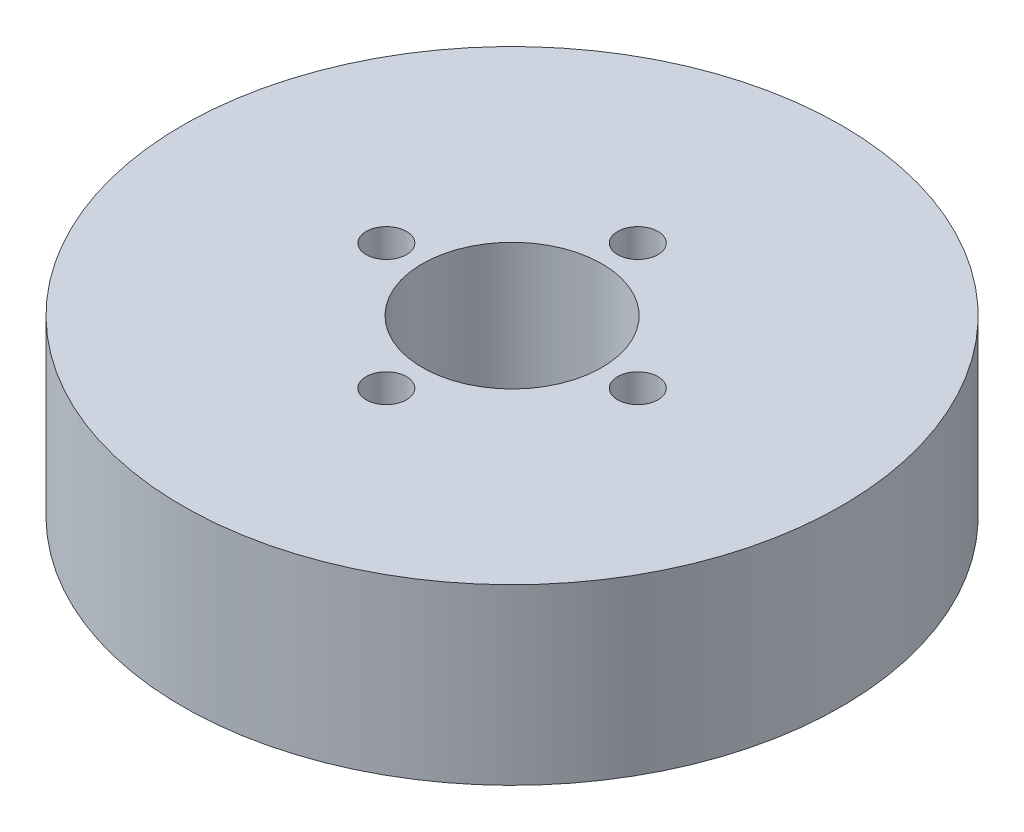
ISO-10303-21;
HEADER;
FILE_DESCRIPTION(('STEP AP214'),'2;1');
FILE_NAME('part.step','',(''),(''),'','','');
FILE_SCHEMA(('AUTOMOTIVE_DESIGN { 1 0 10303 214 1 1 1 1 }'));
ENDSEC;
DATA;
#1=APPLICATION_CONTEXT('core data for automotive mechanical design processes');
#2=APPLICATION_PROTOCOL_DEFINITION('international standard','automotive_design',2000,#1);
#3=PRODUCT_CONTEXT('',#1,'mechanical');
#4=PRODUCT('Part','Part','',(#3));
#5=PRODUCT_RELATED_PRODUCT_CATEGORY('part','',(#4));
#6=PRODUCT_DEFINITION_FORMATION('','',#4);
#7=PRODUCT_DEFINITION_CONTEXT('part definition',#1,'design');
#8=PRODUCT_DEFINITION('design','',#6,#7);
#9=PRODUCT_DEFINITION_SHAPE('','',#8);
#10=(LENGTH_UNIT() NAMED_UNIT(*) SI_UNIT(.MILLI.,.METRE.));
#11=(NAMED_UNIT(*) PLANE_ANGLE_UNIT() SI_UNIT($,.RADIAN.));
#12=(NAMED_UNIT(*) SI_UNIT($,.STERADIAN.) SOLID_ANGLE_UNIT());
#13=UNCERTAINTY_MEASURE_WITH_UNIT(LENGTH_MEASURE(1.E-05),#10,'distance_accuracy_value','');
#14=(GEOMETRIC_REPRESENTATION_CONTEXT(3) GLOBAL_UNCERTAINTY_ASSIGNED_CONTEXT((#13)) GLOBAL_UNIT_ASSIGNED_CONTEXT((#10,
#11,#12)) REPRESENTATION_CONTEXT('',''));
#15=CARTESIAN_POINT('',(0.,0.,0.));
#16=DIRECTION('',(0.,0.,1.));
#17=DIRECTION('',(1.,0.,0.));
#18=AXIS2_PLACEMENT_3D('',#15,#16,#17);
#19=CARTESIAN_POINT('',(0.,29.,0.));
#20=DIRECTION('',(0.,-1.,0.));
#21=DIRECTION('',(0.,0.,-1.));
#22=AXIS2_PLACEMENT_3D('',#19,#20,#21);
#23=CYLINDRICAL_SURFACE('',#22,55.);
#24=CARTESIAN_POINT('',(0.,29.,0.));
#25=DIRECTION('',(0.,1.,0.));
#26=DIRECTION('',(0.,0.,1.));
#27=AXIS2_PLACEMENT_3D('',#24,#25,#26);
#28=CIRCLE('',#27,55.);
#29=CARTESIAN_POINT('',(0.,29.,-55.));
#30=VERTEX_POINT('',#29);
#31=EDGE_CURVE('E10',#30,#30,#28,.T.);
#32=CARTESIAN_POINT('',(0.,0.,0.));
#33=DIRECTION('',(0.,1.,0.));
#34=DIRECTION('',(0.,0.,1.));
#35=AXIS2_PLACEMENT_3D('',#32,#33,#34);
#36=CIRCLE('',#35,55.);
#37=CARTESIAN_POINT('',(0.,0.,-55.));
#38=VERTEX_POINT('',#37);
#39=EDGE_CURVE('E37',#38,#38,#36,.T.);
#40=CARTESIAN_POINT('',(0.,29.,-55.));
#41=CARTESIAN_POINT('',(0.,28.6979166666667,-55.));
#42=CARTESIAN_POINT('',(0.,28.3958333333333,-55.));
#43=CARTESIAN_POINT('',(0.,27.7916666666667,-55.));
#44=CARTESIAN_POINT('',(0.,27.4895833333333,-55.));
#45=CARTESIAN_POINT('',(0.,26.8854166666667,-55.));
#46=CARTESIAN_POINT('',(0.,26.5833333333333,-55.));
#47=CARTESIAN_POINT('',(0.,25.9791666666667,-55.));
#48=CARTESIAN_POINT('',(0.,25.6770833333333,-55.));
#49=CARTESIAN_POINT('',(0.,25.0729166666667,-55.));
#50=CARTESIAN_POINT('',(0.,24.7708333333333,-55.));
#51=CARTESIAN_POINT('',(0.,24.1666666666667,-55.));
#52=CARTESIAN_POINT('',(0.,23.8645833333333,-55.));
#53=CARTESIAN_POINT('',(0.,23.2604166666667,-55.));
#54=CARTESIAN_POINT('',(0.,22.9583333333333,-55.));
#55=CARTESIAN_POINT('',(0.,22.3541666666667,-55.));
#56=CARTESIAN_POINT('',(0.,22.0520833333333,-55.));
#57=CARTESIAN_POINT('',(0.,21.4479166666667,-55.));
#58=CARTESIAN_POINT('',(0.,21.1458333333333,-55.));
#59=CARTESIAN_POINT('',(0.,20.5416666666667,-55.));
#60=CARTESIAN_POINT('',(0.,20.2395833333333,-55.));
#61=CARTESIAN_POINT('',(0.,19.6354166666667,-55.));
#62=CARTESIAN_POINT('',(0.,19.3333333333333,-55.));
#63=CARTESIAN_POINT('',(0.,18.7291666666667,-55.));
#64=CARTESIAN_POINT('',(0.,18.4270833333333,-55.));
#65=CARTESIAN_POINT('',(0.,17.8229166666667,-55.));
#66=CARTESIAN_POINT('',(0.,17.5208333333333,-55.));
#67=CARTESIAN_POINT('',(0.,16.9166666666667,-55.));
#68=CARTESIAN_POINT('',(0.,16.6145833333333,-55.));
#69=CARTESIAN_POINT('',(0.,16.0104166666667,-55.));
#70=CARTESIAN_POINT('',(0.,15.7083333333333,-55.));
#71=CARTESIAN_POINT('',(0.,15.1041666666667,-55.));
#72=CARTESIAN_POINT('',(0.,14.8020833333333,-55.));
#73=CARTESIAN_POINT('',(0.,14.1979166666667,-55.));
#74=CARTESIAN_POINT('',(0.,13.8958333333333,-55.));
#75=CARTESIAN_POINT('',(0.,13.2916666666667,-55.));
#76=CARTESIAN_POINT('',(0.,12.9895833333333,-55.));
#77=CARTESIAN_POINT('',(0.,12.3854166666667,-55.));
#78=CARTESIAN_POINT('',(0.,12.0833333333333,-55.));
#79=CARTESIAN_POINT('',(0.,11.4791666666667,-55.));
#80=CARTESIAN_POINT('',(0.,11.1770833333333,-55.));
#81=CARTESIAN_POINT('',(0.,10.5729166666667,-55.));
#82=CARTESIAN_POINT('',(0.,10.2708333333333,-55.));
#83=CARTESIAN_POINT('',(0.,9.66666666666667,-55.));
#84=CARTESIAN_POINT('',(0.,9.36458333333333,-55.));
#85=CARTESIAN_POINT('',(0.,8.76041666666667,-55.));
#86=CARTESIAN_POINT('',(0.,8.45833333333333,-55.));
#87=CARTESIAN_POINT('',(0.,7.85416666666667,-55.));
#88=CARTESIAN_POINT('',(0.,7.55208333333333,-55.));
#89=CARTESIAN_POINT('',(0.,6.94791666666667,-55.));
#90=CARTESIAN_POINT('',(0.,6.64583333333333,-55.));
#91=CARTESIAN_POINT('',(0.,6.04166666666667,-55.));
#92=CARTESIAN_POINT('',(0.,5.73958333333333,-55.));
#93=CARTESIAN_POINT('',(0.,5.13541666666667,-55.));
#94=CARTESIAN_POINT('',(0.,4.83333333333333,-55.));
#95=CARTESIAN_POINT('',(0.,4.22916666666667,-55.));
#96=CARTESIAN_POINT('',(0.,3.92708333333333,-55.));
#97=CARTESIAN_POINT('',(0.,3.32291666666667,-55.));
#98=CARTESIAN_POINT('',(0.,3.02083333333333,-55.));
#99=CARTESIAN_POINT('',(0.,2.41666666666667,-55.));
#100=CARTESIAN_POINT('',(0.,2.11458333333333,-55.));
#101=CARTESIAN_POINT('',(0.,1.51041666666667,-55.));
#102=CARTESIAN_POINT('',(0.,1.20833333333333,-55.));
#103=CARTESIAN_POINT('',(0.,0.604166666666667,-55.));
#104=CARTESIAN_POINT('',(0.,0.302083333333333,-55.));
#105=CARTESIAN_POINT('',(0.,0.,-55.));
#106=B_SPLINE_CURVE_WITH_KNOTS('',3,(#40,#41,#42,#43,#44,#45,#46,#47,#48,#49,#50,#51,#52,#53,
#54,#55,#56,#57,#58,#59,#60,#61,#62,#63,#64,#65,#66,#67,#68,#69,#70,#71,#72,#73,#74,#75,#76,#77,
#78,#79,#80,#81,#82,#83,#84,#85,#86,#87,#88,#89,#90,#91,#92,#93,#94,#95,#96,#97,#98,#99,#100,
#101,#102,#103,#104,#105),.UNSPECIFIED.,.F.,.F.,(4,2,2,2,2,2,2,2,2,2,2,2,2,2,2,2,2,2,2,2,2,2,2,
2,2,2,2,2,2,2,2,2,4),(0.,0.906250000000001,1.8125,2.71875,3.625,4.53125,5.4375,6.34375,7.25,
8.15625,9.0625,9.96875,10.875,11.78125,12.6875,13.59375,14.5,15.40625,16.3125,17.21875,18.125,
19.03125,19.9375,20.84375,21.75,22.65625,23.5625,24.46875,25.375,26.28125,27.1875,28.09375,29.),.UNSPECIFIED.);
#107=EDGE_CURVE('BSEAM40',#30,#38,#106,.T.);
#108=ORIENTED_EDGE('',*,*,#31,.F.);
#109=ORIENTED_EDGE('',*,*,#39,.T.);
#110=ORIENTED_EDGE('',*,*,#107,.T.);
#111=ORIENTED_EDGE('',*,*,#107,.F.);
#112=EDGE_LOOP('',(#108,#110,#109,#111));
#113=FACE_BOUND('',#112,.T.);
#114=ADVANCED_FACE('F40',(#113),#23,.T.);
#115=CARTESIAN_POINT('',(0.,29.,0.));
#116=DIRECTION('',(0.,1.,0.));
#117=DIRECTION('',(0.,0.,1.));
#118=AXIS2_PLACEMENT_3D('',#115,#116,#117);
#119=PLANE('',#118);
#120=CARTESIAN_POINT('',(0.,29.,20.9811069442111));
#121=DIRECTION('',(0.,1.,0.));
#122=DIRECTION('',(1.,0.,0.));
#123=AXIS2_PLACEMENT_3D('',#120,#121,#122);
#124=CIRCLE('',#123,3.36614820400758);
#125=CARTESIAN_POINT('',(3.36614820400765,29.,20.9811069442111));
#126=VERTEX_POINT('',#125);
#127=EDGE_CURVE('E71',#126,#126,#124,.T.);
#128=ORIENTED_EDGE('',*,*,#127,.F.);
#129=EDGE_LOOP('',(#128));
#130=FACE_BOUND('',#129,.T.);
#131=CARTESIAN_POINT('',(20.9811069442111,29.,0.));
#132=DIRECTION('',(0.,1.,0.));
#133=DIRECTION('',(0.,0.,-1.));
#134=AXIS2_PLACEMENT_3D('',#131,#132,#133);
#135=CIRCLE('',#134,3.36614820400758);
#136=CARTESIAN_POINT('',(20.9811069442111,29.,-3.36614820400758));
#137=VERTEX_POINT('',#136);
#138=EDGE_CURVE('E70',#137,#137,#135,.T.);
#139=ORIENTED_EDGE('',*,*,#138,.F.);
#140=EDGE_LOOP('',(#139));
#141=FACE_BOUND('',#140,.T.);
#142=CARTESIAN_POINT('',(-2.19765430091956E-13,29.,-20.9811069442111));
#143=DIRECTION('',(0.,1.,0.));
#144=DIRECTION('',(-1.,0.,0.));
#145=AXIS2_PLACEMENT_3D('',#142,#143,#144);
#146=CIRCLE('',#145,3.36614820400758);
#147=CARTESIAN_POINT('',(-3.3661482040078,29.,-20.9811069442111));
#148=VERTEX_POINT('',#147);
#149=EDGE_CURVE('E61',#148,#148,#146,.T.);
#150=ORIENTED_EDGE('',*,*,#149,.F.);
#151=EDGE_LOOP('',(#150));
#152=FACE_BOUND('',#151,.T.);
#153=CARTESIAN_POINT('',(-20.9811069442111,29.,0.));
#154=DIRECTION('',(0.,1.,0.));
#155=DIRECTION('',(0.,0.,1.));
#156=AXIS2_PLACEMENT_3D('',#153,#154,#155);
#157=CIRCLE('',#156,3.36614820400758);
#158=CARTESIAN_POINT('',(-20.9811069442111,29.,3.36614820400758));
#159=VERTEX_POINT('',#158);
#160=EDGE_CURVE('E54',#159,#159,#157,.T.);
#161=ORIENTED_EDGE('',*,*,#160,.F.);
#162=EDGE_LOOP('',(#161));
#163=FACE_BOUND('',#162,.T.);
#164=CARTESIAN_POINT('',(0.,29.,0.));
#165=DIRECTION('',(0.,1.,0.));
#166=DIRECTION('',(0.,0.,1.));
#167=AXIS2_PLACEMENT_3D('',#164,#165,#166);
#168=CIRCLE('',#167,15.);
#169=CARTESIAN_POINT('',(0.,29.,-15.));
#170=VERTEX_POINT('',#169);
#171=EDGE_CURVE('E50',#170,#170,#168,.T.);
#172=ORIENTED_EDGE('',*,*,#171,.F.);
#173=EDGE_LOOP('',(#172));
#174=FACE_BOUND('',#173,.T.);
#175=ORIENTED_EDGE('',*,*,#31,.T.);
#176=EDGE_LOOP('',(#175));
#177=FACE_BOUND('',#176,.T.);
#178=ADVANCED_FACE('F86',(#130,#141,#152,#163,#174,#177),#119,.T.);
#179=CARTESIAN_POINT('',(0.,0.,0.));
#180=DIRECTION('',(0.,1.,0.));
#181=DIRECTION('',(0.,0.,1.));
#182=AXIS2_PLACEMENT_3D('',#179,#180,#181);
#183=PLANE('',#182);
#184=CARTESIAN_POINT('',(0.,0.,0.));
#185=DIRECTION('',(0.,1.,0.));
#186=DIRECTION('',(0.,0.,1.));
#187=AXIS2_PLACEMENT_3D('',#184,#185,#186);
#188=CIRCLE('',#187,15.);
#189=CARTESIAN_POINT('',(0.,0.,-15.));
#190=VERTEX_POINT('',#189);
#191=EDGE_CURVE('E47',#190,#190,#188,.T.);
#192=ORIENTED_EDGE('',*,*,#191,.T.);
#193=EDGE_LOOP('',(#192));
#194=FACE_BOUND('',#193,.T.);
#195=ORIENTED_EDGE('',*,*,#39,.F.);
#196=EDGE_LOOP('',(#195));
#197=FACE_BOUND('',#196,.T.);
#198=ADVANCED_FACE('F93',(#194,#197),#183,.F.);
#199=CARTESIAN_POINT('',(0.,29.,0.));
#200=DIRECTION('',(0.,-1.,0.));
#201=DIRECTION('',(0.,0.,-1.));
#202=AXIS2_PLACEMENT_3D('',#199,#200,#201);
#203=CYLINDRICAL_SURFACE('',#202,15.);
#204=CARTESIAN_POINT('',(0.,29.,-15.));
#205=CARTESIAN_POINT('',(0.,28.6979166666667,-15.));
#206=CARTESIAN_POINT('',(0.,28.3958333333333,-15.));
#207=CARTESIAN_POINT('',(0.,27.7916666666667,-15.));
#208=CARTESIAN_POINT('',(0.,27.4895833333333,-15.));
#209=CARTESIAN_POINT('',(0.,26.8854166666667,-15.));
#210=CARTESIAN_POINT('',(0.,26.5833333333333,-15.));
#211=CARTESIAN_POINT('',(0.,25.9791666666667,-15.));
#212=CARTESIAN_POINT('',(0.,25.6770833333333,-15.));
#213=CARTESIAN_POINT('',(0.,25.0729166666667,-15.));
#214=CARTESIAN_POINT('',(0.,24.7708333333333,-15.));
#215=CARTESIAN_POINT('',(0.,24.1666666666667,-15.));
#216=CARTESIAN_POINT('',(0.,23.8645833333333,-15.));
#217=CARTESIAN_POINT('',(0.,23.2604166666667,-15.));
#218=CARTESIAN_POINT('',(0.,22.9583333333333,-15.));
#219=CARTESIAN_POINT('',(0.,22.3541666666667,-15.));
#220=CARTESIAN_POINT('',(0.,22.0520833333333,-15.));
#221=CARTESIAN_POINT('',(0.,21.4479166666667,-15.));
#222=CARTESIAN_POINT('',(0.,21.1458333333333,-15.));
#223=CARTESIAN_POINT('',(0.,20.5416666666667,-15.));
#224=CARTESIAN_POINT('',(0.,20.2395833333333,-15.));
#225=CARTESIAN_POINT('',(0.,19.6354166666667,-15.));
#226=CARTESIAN_POINT('',(0.,19.3333333333333,-15.));
#227=CARTESIAN_POINT('',(0.,18.7291666666667,-15.));
#228=CARTESIAN_POINT('',(0.,18.4270833333333,-15.));
#229=CARTESIAN_POINT('',(0.,17.8229166666667,-15.));
#230=CARTESIAN_POINT('',(0.,17.5208333333333,-15.));
#231=CARTESIAN_POINT('',(0.,16.9166666666667,-15.));
#232=CARTESIAN_POINT('',(0.,16.6145833333333,-15.));
#233=CARTESIAN_POINT('',(0.,16.0104166666667,-15.));
#234=CARTESIAN_POINT('',(0.,15.7083333333333,-15.));
#235=CARTESIAN_POINT('',(0.,15.1041666666667,-15.));
#236=CARTESIAN_POINT('',(0.,14.8020833333333,-15.));
#237=CARTESIAN_POINT('',(0.,14.1979166666667,-15.));
#238=CARTESIAN_POINT('',(0.,13.8958333333333,-15.));
#239=CARTESIAN_POINT('',(0.,13.2916666666667,-15.));
#240=CARTESIAN_POINT('',(0.,12.9895833333333,-15.));
#241=CARTESIAN_POINT('',(0.,12.3854166666667,-15.));
#242=CARTESIAN_POINT('',(0.,12.0833333333333,-15.));
#243=CARTESIAN_POINT('',(0.,11.4791666666667,-15.));
#244=CARTESIAN_POINT('',(0.,11.1770833333333,-15.));
#245=CARTESIAN_POINT('',(0.,10.5729166666667,-15.));
#246=CARTESIAN_POINT('',(0.,10.2708333333333,-15.));
#247=CARTESIAN_POINT('',(0.,9.66666666666667,-15.));
#248=CARTESIAN_POINT('',(0.,9.36458333333333,-15.));
#249=CARTESIAN_POINT('',(0.,8.76041666666667,-15.));
#250=CARTESIAN_POINT('',(0.,8.45833333333333,-15.));
#251=CARTESIAN_POINT('',(0.,7.85416666666667,-15.));
#252=CARTESIAN_POINT('',(0.,7.55208333333333,-15.));
#253=CARTESIAN_POINT('',(0.,6.94791666666667,-15.));
#254=CARTESIAN_POINT('',(0.,6.64583333333333,-15.));
#255=CARTESIAN_POINT('',(0.,6.04166666666667,-15.));
#256=CARTESIAN_POINT('',(0.,5.73958333333333,-15.));
#257=CARTESIAN_POINT('',(0.,5.13541666666667,-15.));
#258=CARTESIAN_POINT('',(0.,4.83333333333333,-15.));
#259=CARTESIAN_POINT('',(0.,4.22916666666667,-15.));
#260=CARTESIAN_POINT('',(0.,3.92708333333333,-15.));
#261=CARTESIAN_POINT('',(0.,3.32291666666667,-15.));
#262=CARTESIAN_POINT('',(0.,3.02083333333333,-15.));
#263=CARTESIAN_POINT('',(0.,2.41666666666667,-15.));
#264=CARTESIAN_POINT('',(0.,2.11458333333333,-15.));
#265=CARTESIAN_POINT('',(0.,1.51041666666667,-15.));
#266=CARTESIAN_POINT('',(0.,1.20833333333333,-15.));
#267=CARTESIAN_POINT('',(0.,0.604166666666667,-15.));
#268=CARTESIAN_POINT('',(0.,0.302083333333333,-15.));
#269=CARTESIAN_POINT('',(0.,0.,-15.));
#270=B_SPLINE_CURVE_WITH_KNOTS('',3,(#204,#205,#206,#207,#208,#209,#210,#211,#212,#213,#214,
#215,#216,#217,#218,#219,#220,#221,#222,#223,#224,#225,#226,#227,#228,#229,#230,#231,#232,#233,
#234,#235,#236,#237,#238,#239,#240,#241,#242,#243,#244,#245,#246,#247,#248,#249,#250,#251,#252,
#253,#254,#255,#256,#257,#258,#259,#260,#261,#262,#263,#264,#265,#266,#267,#268,#269),
.UNSPECIFIED.,.F.,.F.,(4,2,2,2,2,2,2,2,2,2,2,2,2,2,2,2,2,2,2,2,2,2,2,2,2,2,2,2,2,2,2,2,4),(0.,
0.906250000000001,1.8125,2.71875,3.625,4.53125,5.4375,6.34375,7.25,8.15625,9.0625,9.96875,
10.875,11.78125,12.6875,13.59375,14.5,15.40625,16.3125,17.21875,18.125,19.03125,19.9375,
20.84375,21.75,22.65625,23.5625,24.46875,25.375,26.28125,27.1875,28.09375,29.),.UNSPECIFIED.);
#271=EDGE_CURVE('BSEAM101',#170,#190,#270,.T.);
#272=ORIENTED_EDGE('',*,*,#171,.T.);
#273=ORIENTED_EDGE('',*,*,#191,.F.);
#274=ORIENTED_EDGE('',*,*,#271,.T.);
#275=ORIENTED_EDGE('',*,*,#271,.F.);
#276=EDGE_LOOP('',(#272,#274,#273,#275));
#277=FACE_BOUND('',#276,.T.);
#278=ADVANCED_FACE('F101',(#277),#203,.F.);
#279=CARTESIAN_POINT('',(-20.9811069442111,9.75746053115306,0.));
#280=DIRECTION('',(0.,1.,0.));
#281=DIRECTION('',(0.,0.,1.));
#282=AXIS2_PLACEMENT_3D('',#279,#280,#281);
#283=CYLINDRICAL_SURFACE('',#282,3.36614820400758);
#284=CARTESIAN_POINT('',(-20.9811069442111,9.75746053115306,0.));
#285=DIRECTION('',(0.,1.,0.));
#286=DIRECTION('',(0.,0.,1.));
#287=AXIS2_PLACEMENT_3D('',#284,#285,#286);
#288=CIRCLE('',#287,3.36614820400758);
#289=CARTESIAN_POINT('',(-20.9811069442111,9.75746053115306,3.36614820400758));
#290=VERTEX_POINT('',#289);
#291=EDGE_CURVE('E55',#290,#290,#288,.T.);
#292=ORIENTED_EDGE('',*,*,#291,.F.);
#293=EDGE_LOOP('',(#292));
#294=FACE_BOUND('',#293,.T.);
#295=ORIENTED_EDGE('',*,*,#160,.T.);
#296=EDGE_LOOP('',(#295));
#297=FACE_BOUND('',#296,.T.);
#298=ADVANCED_FACE('F102',(#294,#297),#283,.F.);
#299=CARTESIAN_POINT('',(-20.9811069442111,9.75746053115306,0.));
#300=DIRECTION('',(0.,1.,0.));
#301=DIRECTION('',(0.,0.,1.));
#302=AXIS2_PLACEMENT_3D('',#299,#300,#301);
#303=PLANE('',#302);
#304=ORIENTED_EDGE('',*,*,#291,.T.);
#305=EDGE_LOOP('',(#304));
#306=FACE_BOUND('',#305,.T.);
#307=ADVANCED_FACE('F133',(#306),#303,.T.);
#308=CARTESIAN_POINT('',(-2.19765430091956E-13,9.75746053115306,-20.9811069442111));
#309=DIRECTION('',(0.,1.,0.));
#310=DIRECTION('',(0.,0.,1.));
#311=AXIS2_PLACEMENT_3D('',#308,#309,#310);
#312=CYLINDRICAL_SURFACE('',#311,3.36614820400758);
#313=CARTESIAN_POINT('',(-2.19765430091956E-13,9.75746053115306,-20.9811069442111));
#314=DIRECTION('',(0.,1.,0.));
#315=DIRECTION('',(-1.,0.,0.));
#316=AXIS2_PLACEMENT_3D('',#313,#314,#315);
#317=CIRCLE('',#316,3.36614820400758);
#318=CARTESIAN_POINT('',(-3.3661482040078,9.75746053115306,-20.9811069442111));
#319=VERTEX_POINT('',#318);
#320=EDGE_CURVE('E63',#319,#319,#317,.T.);
#321=ORIENTED_EDGE('',*,*,#320,.F.);
#322=EDGE_LOOP('',(#321));
#323=FACE_BOUND('',#322,.T.);
#324=ORIENTED_EDGE('',*,*,#149,.T.);
#325=EDGE_LOOP('',(#324));
#326=FACE_BOUND('',#325,.T.);
#327=ADVANCED_FACE('F142',(#323,#326),#312,.F.);
#328=CARTESIAN_POINT('',(-2.19765430091956E-13,9.75746053115306,-20.9811069442111));
#329=DIRECTION('',(0.,1.,0.));
#330=DIRECTION('',(-1.,0.,0.));
#331=AXIS2_PLACEMENT_3D('',#328,#329,#330);
#332=PLANE('',#331);
#333=ORIENTED_EDGE('',*,*,#320,.T.);
#334=EDGE_LOOP('',(#333));
#335=FACE_BOUND('',#334,.T.);
#336=ADVANCED_FACE('F156',(#335),#332,.T.);
#337=CARTESIAN_POINT('',(20.9811069442111,9.75746053115306,0.));
#338=DIRECTION('',(0.,1.,0.));
#339=DIRECTION('',(0.,0.,1.));
#340=AXIS2_PLACEMENT_3D('',#337,#338,#339);
#341=CYLINDRICAL_SURFACE('',#340,3.36614820400758);
#342=CARTESIAN_POINT('',(20.9811069442111,9.75746053115306,0.));
#343=DIRECTION('',(0.,1.,0.));
#344=DIRECTION('',(0.,0.,-1.));
#345=AXIS2_PLACEMENT_3D('',#342,#343,#344);
#346=CIRCLE('',#345,3.36614820400758);
#347=CARTESIAN_POINT('',(20.9811069442111,9.75746053115306,-3.36614820400758));
#348=VERTEX_POINT('',#347);
#349=EDGE_CURVE('E69',#348,#348,#346,.T.);
#350=ORIENTED_EDGE('',*,*,#349,.F.);
#351=EDGE_LOOP('',(#350));
#352=FACE_BOUND('',#351,.T.);
#353=ORIENTED_EDGE('',*,*,#138,.T.);
#354=EDGE_LOOP('',(#353));
#355=FACE_BOUND('',#354,.T.);
#356=ADVANCED_FACE('F164',(#352,#355),#341,.F.);
#357=CARTESIAN_POINT('',(20.9811069442111,9.75746053115306,0.));
#358=DIRECTION('',(0.,1.,0.));
#359=DIRECTION('',(0.,0.,-1.));
#360=AXIS2_PLACEMENT_3D('',#357,#358,#359);
#361=PLANE('',#360);
#362=ORIENTED_EDGE('',*,*,#349,.T.);
#363=EDGE_LOOP('',(#362));
#364=FACE_BOUND('',#363,.T.);
#365=ADVANCED_FACE('F83',(#364),#361,.T.);
#366=CARTESIAN_POINT('',(0.,9.75746053115306,20.9811069442111));
#367=DIRECTION('',(0.,1.,0.));
#368=DIRECTION('',(0.,0.,1.));
#369=AXIS2_PLACEMENT_3D('',#366,#367,#368);
#370=CYLINDRICAL_SURFACE('',#369,3.36614820400758);
#371=CARTESIAN_POINT('',(0.,9.75746053115306,20.9811069442111));
#372=DIRECTION('',(0.,1.,0.));
#373=DIRECTION('',(1.,0.,0.));
#374=AXIS2_PLACEMENT_3D('',#371,#372,#373);
#375=CIRCLE('',#374,3.36614820400758);
#376=CARTESIAN_POINT('',(3.36614820400765,9.75746053115306,20.9811069442111));
#377=VERTEX_POINT('',#376);
#378=EDGE_CURVE('E59',#377,#377,#375,.T.);
#379=ORIENTED_EDGE('',*,*,#378,.F.);
#380=EDGE_LOOP('',(#379));
#381=FACE_BOUND('',#380,.T.);
#382=ORIENTED_EDGE('',*,*,#127,.T.);
#383=EDGE_LOOP('',(#382));
#384=FACE_BOUND('',#383,.T.);
#385=ADVANCED_FACE('F81',(#381,#384),#370,.F.);
#386=CARTESIAN_POINT('',(0.,9.75746053115306,20.9811069442111));
#387=DIRECTION('',(0.,1.,0.));
#388=DIRECTION('',(1.,0.,0.));
#389=AXIS2_PLACEMENT_3D('',#386,#387,#388);
#390=PLANE('',#389);
#391=ORIENTED_EDGE('',*,*,#378,.T.);
#392=EDGE_LOOP('',(#391));
#393=FACE_BOUND('',#392,.T.);
#394=ADVANCED_FACE('F78',(#393),#390,.T.);
#395=CLOSED_SHELL('',(#114,#178,#198,#278,#298,#307,#327,#336,#356,#365,#385,#394));
#396=MANIFOLD_SOLID_BREP('B2',#395);
#397=ADVANCED_BREP_SHAPE_REPRESENTATION('',(#18,#396),#14);
#398=SHAPE_DEFINITION_REPRESENTATION(#9,#397);
ENDSEC;
END-ISO-10303-21;
